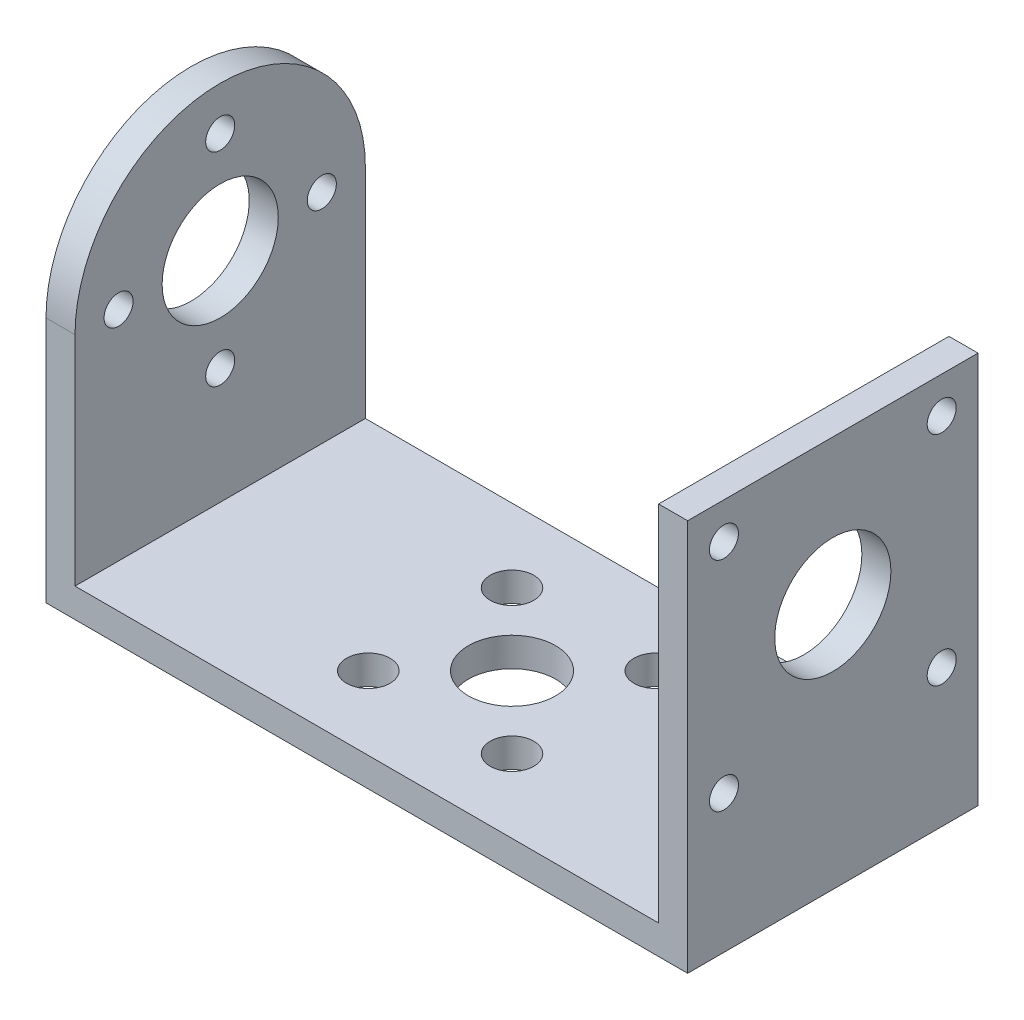
ISO-10303-21;
HEADER;
FILE_DESCRIPTION(('STEP AP214'),'2;1');
FILE_NAME('part.step','',(''),(''),'','','');
FILE_SCHEMA(('AUTOMOTIVE_DESIGN { 1 0 10303 214 1 1 1 1 }'));
ENDSEC;
DATA;
#1=APPLICATION_CONTEXT('core data for automotive mechanical design processes');
#2=APPLICATION_PROTOCOL_DEFINITION('international standard','automotive_design',2000,#1);
#3=PRODUCT_CONTEXT('',#1,'mechanical');
#4=PRODUCT('Part','Part','',(#3));
#5=PRODUCT_RELATED_PRODUCT_CATEGORY('part','',(#4));
#6=PRODUCT_DEFINITION_FORMATION('','',#4);
#7=PRODUCT_DEFINITION_CONTEXT('part definition',#1,'design');
#8=PRODUCT_DEFINITION('design','',#6,#7);
#9=PRODUCT_DEFINITION_SHAPE('','',#8);
#10=(LENGTH_UNIT() NAMED_UNIT(*) SI_UNIT(.MILLI.,.METRE.));
#11=(NAMED_UNIT(*) PLANE_ANGLE_UNIT() SI_UNIT($,.RADIAN.));
#12=(NAMED_UNIT(*) SI_UNIT($,.STERADIAN.) SOLID_ANGLE_UNIT());
#13=UNCERTAINTY_MEASURE_WITH_UNIT(LENGTH_MEASURE(1.E-05),#10,'distance_accuracy_value','');
#14=(GEOMETRIC_REPRESENTATION_CONTEXT(3) GLOBAL_UNCERTAINTY_ASSIGNED_CONTEXT((#13)) GLOBAL_UNIT_ASSIGNED_CONTEXT((#10,
#11,#12)) REPRESENTATION_CONTEXT('',''));
#15=CARTESIAN_POINT('',(0.,0.,0.));
#16=DIRECTION('',(0.,0.,1.));
#17=DIRECTION('',(1.,0.,0.));
#18=AXIS2_PLACEMENT_3D('',#15,#16,#17);
#19=CARTESIAN_POINT('',(-22.1,2.,10.));
#20=DIRECTION('',(1.,0.,0.));
#21=DIRECTION('',(0.,0.,-1.));
#22=AXIS2_PLACEMENT_3D('',#19,#20,#21);
#23=PLANE('',#22);
#24=CARTESIAN_POINT('',(-22.1,17.,0.));
#25=DIRECTION('',(-1.,0.,0.));
#26=DIRECTION('',(0.,0.,1.));
#27=AXIS2_PLACEMENT_3D('',#24,#25,#26);
#28=CIRCLE('',#27,4.);
#29=CARTESIAN_POINT('',(-22.1,17.,4.));
#30=VERTEX_POINT('',#29);
#31=EDGE_CURVE('E288',#30,#30,#28,.T.);
#32=ORIENTED_EDGE('',*,*,#31,.F.);
#33=EDGE_LOOP('',(#32));
#34=FACE_BOUND('',#33,.T.);
#35=CARTESIAN_POINT('',(-22.1,10.,3.46818829043387E-13));
#36=DIRECTION('',(-1.,0.,0.));
#37=DIRECTION('',(0.,0.,1.));
#38=AXIS2_PLACEMENT_3D('',#35,#36,#37);
#39=CIRCLE('',#38,1.);
#40=CARTESIAN_POINT('',(-22.1,10.,1.00000000000035));
#41=VERTEX_POINT('',#40);
#42=EDGE_CURVE('E187',#41,#41,#39,.T.);
#43=ORIENTED_EDGE('',*,*,#42,.F.);
#44=EDGE_LOOP('',(#43));
#45=FACE_BOUND('',#44,.T.);
#46=CARTESIAN_POINT('',(-22.1,16.9999999999999,-6.9999999999998));
#47=DIRECTION('',(-1.,0.,0.));
#48=DIRECTION('',(0.,0.,1.));
#49=AXIS2_PLACEMENT_3D('',#46,#47,#48);
#50=CIRCLE('',#49,0.999999999999999);
#51=CARTESIAN_POINT('',(-22.1,16.9999999999999,-5.9999999999998));
#52=VERTEX_POINT('',#51);
#53=EDGE_CURVE('E265',#52,#52,#50,.T.);
#54=ORIENTED_EDGE('',*,*,#53,.F.);
#55=EDGE_LOOP('',(#54));
#56=FACE_BOUND('',#55,.T.);
#57=CARTESIAN_POINT('',(-22.1,24.,0.));
#58=DIRECTION('',(-1.,0.,0.));
#59=DIRECTION('',(0.,0.,1.));
#60=AXIS2_PLACEMENT_3D('',#57,#58,#59);
#61=CIRCLE('',#60,1.);
#62=CARTESIAN_POINT('',(-22.1,24.,1.));
#63=VERTEX_POINT('',#62);
#64=EDGE_CURVE('E272',#63,#63,#61,.T.);
#65=ORIENTED_EDGE('',*,*,#64,.F.);
#66=EDGE_LOOP('',(#65));
#67=FACE_BOUND('',#66,.T.);
#68=CARTESIAN_POINT('',(-22.1,17.0000000000002,7.0000000000002));
#69=DIRECTION('',(-1.,0.,0.));
#70=DIRECTION('',(0.,0.,1.));
#71=AXIS2_PLACEMENT_3D('',#68,#69,#70);
#72=CIRCLE('',#71,1.);
#73=CARTESIAN_POINT('',(-22.1,17.0000000000002,8.0000000000002));
#74=VERTEX_POINT('',#73);
#75=EDGE_CURVE('E278',#74,#74,#72,.T.);
#76=ORIENTED_EDGE('',*,*,#75,.F.);
#77=EDGE_LOOP('',(#76));
#78=FACE_BOUND('',#77,.T.);
#79=CARTESIAN_POINT('',(-22.1,17.,0.));
#80=DIRECTION('',(-1.,0.,0.));
#81=DIRECTION('',(0.,0.,1.));
#82=AXIS2_PLACEMENT_3D('',#79,#80,#81);
#83=CIRCLE('',#82,10.);
#84=CARTESIAN_POINT('',(-22.1,17.,10.));
#85=VERTEX_POINT('',#84);
#86=CARTESIAN_POINT('',(-22.1,17.,-10.));
#87=VERTEX_POINT('',#86);
#88=EDGE_CURVE('E173',#85,#87,#83,.T.);
#89=ORIENTED_EDGE('',*,*,#88,.T.);
#90=DIRECTION('',(0.,-1.,0.));
#91=VECTOR('',#90,1.);
#92=CARTESIAN_POINT('',(-22.1,2.,-10.));
#93=LINE('',#92,#91);
#94=CARTESIAN_POINT('',(-22.1,0.,-10.));
#95=VERTEX_POINT('',#94);
#96=EDGE_CURVE('E116',#87,#95,#93,.T.);
#97=ORIENTED_EDGE('',*,*,#96,.T.);
#98=DIRECTION('',(0.,0.,1.));
#99=VECTOR('',#98,1.);
#100=CARTESIAN_POINT('',(-22.1,0.,10.));
#101=LINE('',#100,#99);
#102=CARTESIAN_POINT('',(-22.1,0.,10.));
#103=VERTEX_POINT('',#102);
#104=EDGE_CURVE('E200',#95,#103,#101,.T.);
#105=ORIENTED_EDGE('',*,*,#104,.T.);
#106=DIRECTION('',(0.,-1.,0.));
#107=VECTOR('',#106,1.);
#108=CARTESIAN_POINT('',(-22.1,2.,10.));
#109=LINE('',#108,#107);
#110=EDGE_CURVE('E178',#85,#103,#109,.T.);
#111=ORIENTED_EDGE('',*,*,#110,.F.);
#112=EDGE_LOOP('',(#89,#97,#105,#111));
#113=FACE_BOUND('',#112,.T.);
#114=ADVANCED_FACE('F108',(#34,#45,#56,#67,#78,#113),#23,.F.);
#115=CARTESIAN_POINT('',(-20.1,0.,0.));
#116=DIRECTION('',(1.,0.,0.));
#117=DIRECTION('',(0.,0.,-1.));
#118=AXIS2_PLACEMENT_3D('',#115,#116,#117);
#119=PLANE('',#118);
#120=CARTESIAN_POINT('',(-20.1,17.,0.));
#121=DIRECTION('',(1.,0.,0.));
#122=DIRECTION('',(0.,0.,-1.));
#123=AXIS2_PLACEMENT_3D('',#120,#121,#122);
#124=CIRCLE('',#123,4.);
#125=CARTESIAN_POINT('',(-20.1,17.,-4.));
#126=VERTEX_POINT('',#125);
#127=EDGE_CURVE('E291',#126,#126,#124,.F.);
#128=ORIENTED_EDGE('',*,*,#127,.T.);
#129=EDGE_LOOP('',(#128));
#130=FACE_BOUND('',#129,.T.);
#131=CARTESIAN_POINT('',(-20.1,10.,3.46818829043387E-13));
#132=DIRECTION('',(1.,0.,0.));
#133=DIRECTION('',(0.,0.,-1.));
#134=AXIS2_PLACEMENT_3D('',#131,#132,#133);
#135=CIRCLE('',#134,1.);
#136=CARTESIAN_POINT('',(-20.1,10.,-0.999999999999654));
#137=VERTEX_POINT('',#136);
#138=EDGE_CURVE('E285',#137,#137,#135,.F.);
#139=ORIENTED_EDGE('',*,*,#138,.T.);
#140=EDGE_LOOP('',(#139));
#141=FACE_BOUND('',#140,.T.);
#142=CARTESIAN_POINT('',(-20.1,17.0000000000002,7.0000000000002));
#143=DIRECTION('',(1.,0.,0.));
#144=DIRECTION('',(0.,0.,-1.));
#145=AXIS2_PLACEMENT_3D('',#142,#143,#144);
#146=CIRCLE('',#145,1.);
#147=CARTESIAN_POINT('',(-20.1,17.0000000000002,6.0000000000002));
#148=VERTEX_POINT('',#147);
#149=EDGE_CURVE('E186',#148,#148,#146,.F.);
#150=ORIENTED_EDGE('',*,*,#149,.T.);
#151=EDGE_LOOP('',(#150));
#152=FACE_BOUND('',#151,.T.);
#153=CARTESIAN_POINT('',(-20.1,24.,0.));
#154=DIRECTION('',(1.,0.,0.));
#155=DIRECTION('',(0.,0.,-1.));
#156=AXIS2_PLACEMENT_3D('',#153,#154,#155);
#157=CIRCLE('',#156,1.);
#158=CARTESIAN_POINT('',(-20.1,24.,-1.));
#159=VERTEX_POINT('',#158);
#160=EDGE_CURVE('E275',#159,#159,#157,.F.);
#161=ORIENTED_EDGE('',*,*,#160,.T.);
#162=EDGE_LOOP('',(#161));
#163=FACE_BOUND('',#162,.T.);
#164=CARTESIAN_POINT('',(-20.1,16.9999999999999,-6.9999999999998));
#165=DIRECTION('',(1.,0.,0.));
#166=DIRECTION('',(0.,0.,-1.));
#167=AXIS2_PLACEMENT_3D('',#164,#165,#166);
#168=CIRCLE('',#167,0.999999999999999);
#169=CARTESIAN_POINT('',(-20.1,16.9999999999999,-7.9999999999998));
#170=VERTEX_POINT('',#169);
#171=EDGE_CURVE('E269',#170,#170,#168,.F.);
#172=ORIENTED_EDGE('',*,*,#171,.T.);
#173=EDGE_LOOP('',(#172));
#174=FACE_BOUND('',#173,.T.);
#175=DIRECTION('',(0.,-1.,0.));
#176=VECTOR('',#175,1.);
#177=CARTESIAN_POINT('',(-20.1,2.,-10.));
#178=LINE('',#177,#176);
#179=CARTESIAN_POINT('',(-20.1,17.,-10.));
#180=VERTEX_POINT('',#179);
#181=CARTESIAN_POINT('',(-20.1,2.,-10.));
#182=VERTEX_POINT('',#181);
#183=EDGE_CURVE('E244',#180,#182,#178,.T.);
#184=ORIENTED_EDGE('',*,*,#183,.F.);
#185=CARTESIAN_POINT('',(-20.1,17.,0.));
#186=DIRECTION('',(1.,0.,0.));
#187=DIRECTION('',(0.,0.,-1.));
#188=AXIS2_PLACEMENT_3D('',#185,#186,#187);
#189=CIRCLE('',#188,10.);
#190=CARTESIAN_POINT('',(-20.1,17.,10.));
#191=VERTEX_POINT('',#190);
#192=EDGE_CURVE('E179',#191,#180,#189,.F.);
#193=ORIENTED_EDGE('',*,*,#192,.F.);
#194=DIRECTION('',(0.,1.,0.));
#195=VECTOR('',#194,1.);
#196=CARTESIAN_POINT('',(-20.1,2.,10.));
#197=LINE('',#196,#195);
#198=CARTESIAN_POINT('',(-20.1,2.,10.));
#199=VERTEX_POINT('',#198);
#200=EDGE_CURVE('E220',#199,#191,#197,.T.);
#201=ORIENTED_EDGE('',*,*,#200,.F.);
#202=DIRECTION('',(0.,0.,1.));
#203=VECTOR('',#202,1.);
#204=CARTESIAN_POINT('',(-20.1,2.,-10.));
#205=LINE('',#204,#203);
#206=EDGE_CURVE('E242',#182,#199,#205,.T.);
#207=ORIENTED_EDGE('',*,*,#206,.F.);
#208=EDGE_LOOP('',(#184,#193,#201,#207));
#209=FACE_BOUND('',#208,.T.);
#210=ADVANCED_FACE('F362',(#130,#141,#152,#163,#174,#209),#119,.T.);
#211=CARTESIAN_POINT('',(-22.1,2.,-10.));
#212=DIRECTION('',(0.,0.,1.));
#213=DIRECTION('',(1.,0.,0.));
#214=AXIS2_PLACEMENT_3D('',#211,#212,#213);
#215=PLANE('',#214);
#216=DIRECTION('',(-1.,0.,0.));
#217=VECTOR('',#216,1.);
#218=CARTESIAN_POINT('',(22.101,17.,-10.));
#219=LINE('',#218,#217);
#220=EDGE_CURVE('E182',#180,#87,#219,.T.);
#221=ORIENTED_EDGE('',*,*,#220,.F.);
#222=ORIENTED_EDGE('',*,*,#183,.T.);
#223=DIRECTION('',(-1.,0.,0.));
#224=VECTOR('',#223,1.);
#225=CARTESIAN_POINT('',(-22.1,2.,-10.));
#226=LINE('',#225,#224);
#227=CARTESIAN_POINT('',(20.1,2.,-10.));
#228=VERTEX_POINT('',#227);
#229=EDGE_CURVE('E199',#228,#182,#226,.T.);
#230=ORIENTED_EDGE('',*,*,#229,.F.);
#231=DIRECTION('',(0.,-1.,0.));
#232=VECTOR('',#231,1.);
#233=CARTESIAN_POINT('',(20.1,2.,-10.));
#234=LINE('',#233,#232);
#235=CARTESIAN_POINT('',(20.1,27.,-10.));
#236=VERTEX_POINT('',#235);
#237=EDGE_CURVE('E256',#236,#228,#234,.T.);
#238=ORIENTED_EDGE('',*,*,#237,.F.);
#239=DIRECTION('',(1.,0.,0.));
#240=VECTOR('',#239,1.);
#241=CARTESIAN_POINT('',(20.1,27.,-10.));
#242=LINE('',#241,#240);
#243=CARTESIAN_POINT('',(22.1,27.,-10.));
#244=VERTEX_POINT('',#243);
#245=EDGE_CURVE('E247',#236,#244,#242,.T.);
#246=ORIENTED_EDGE('',*,*,#245,.T.);
#247=DIRECTION('',(0.,-1.,0.));
#248=VECTOR('',#247,1.);
#249=CARTESIAN_POINT('',(22.1,2.,-10.));
#250=LINE('',#249,#248);
#251=CARTESIAN_POINT('',(22.1,0.,-10.));
#252=VERTEX_POINT('',#251);
#253=EDGE_CURVE('E12',#244,#252,#250,.T.);
#254=ORIENTED_EDGE('',*,*,#253,.T.);
#255=DIRECTION('',(-1.,0.,0.));
#256=VECTOR('',#255,1.);
#257=CARTESIAN_POINT('',(-22.1,0.,-10.));
#258=LINE('',#257,#256);
#259=EDGE_CURVE('E190',#252,#95,#258,.T.);
#260=ORIENTED_EDGE('',*,*,#259,.T.);
#261=ORIENTED_EDGE('',*,*,#96,.F.);
#262=EDGE_LOOP('',(#221,#222,#230,#238,#246,#254,#260,#261));
#263=FACE_BOUND('',#262,.T.);
#264=ADVANCED_FACE('F189',(#263),#215,.F.);
#265=CARTESIAN_POINT('',(22.1,2.,10.));
#266=DIRECTION('',(-1.,0.,0.));
#267=DIRECTION('',(0.,0.,1.));
#268=AXIS2_PLACEMENT_3D('',#265,#266,#267);
#269=PLANE('',#268);
#270=CARTESIAN_POINT('',(22.1,24.5,7.5));
#271=DIRECTION('',(1.,0.,0.));
#272=DIRECTION('',(0.,0.,-1.));
#273=AXIS2_PLACEMENT_3D('',#270,#271,#272);
#274=CIRCLE('',#273,1.);
#275=CARTESIAN_POINT('',(22.1,24.5,6.5));
#276=VERTEX_POINT('',#275);
#277=EDGE_CURVE('E298',#276,#276,#274,.T.);
#278=ORIENTED_EDGE('',*,*,#277,.F.);
#279=EDGE_LOOP('',(#278));
#280=FACE_BOUND('',#279,.T.);
#281=CARTESIAN_POINT('',(22.1,24.5,-7.5));
#282=DIRECTION('',(1.,0.,0.));
#283=DIRECTION('',(0.,0.,-1.));
#284=AXIS2_PLACEMENT_3D('',#281,#282,#283);
#285=CIRCLE('',#284,1.);
#286=CARTESIAN_POINT('',(22.1,24.5,-8.5));
#287=VERTEX_POINT('',#286);
#288=EDGE_CURVE('E314',#287,#287,#285,.T.);
#289=ORIENTED_EDGE('',*,*,#288,.F.);
#290=EDGE_LOOP('',(#289));
#291=FACE_BOUND('',#290,.T.);
#292=CARTESIAN_POINT('',(22.1,9.5,-7.50000000000016));
#293=DIRECTION('',(1.,0.,0.));
#294=DIRECTION('',(0.,0.,-1.));
#295=AXIS2_PLACEMENT_3D('',#292,#293,#294);
#296=CIRCLE('',#295,1.);
#297=CARTESIAN_POINT('',(22.1,9.5,-8.50000000000016));
#298=VERTEX_POINT('',#297);
#299=EDGE_CURVE('E310',#298,#298,#296,.T.);
#300=ORIENTED_EDGE('',*,*,#299,.F.);
#301=EDGE_LOOP('',(#300));
#302=FACE_BOUND('',#301,.T.);
#303=CARTESIAN_POINT('',(22.1,9.5,7.49999999999984));
#304=DIRECTION('',(1.,0.,0.));
#305=DIRECTION('',(0.,0.,-1.));
#306=AXIS2_PLACEMENT_3D('',#303,#304,#305);
#307=CIRCLE('',#306,1.);
#308=CARTESIAN_POINT('',(22.1,9.5,6.49999999999984));
#309=VERTEX_POINT('',#308);
#310=EDGE_CURVE('E304',#309,#309,#307,.T.);
#311=ORIENTED_EDGE('',*,*,#310,.F.);
#312=EDGE_LOOP('',(#311));
#313=FACE_BOUND('',#312,.T.);
#314=CARTESIAN_POINT('',(22.1,17.,0.));
#315=DIRECTION('',(1.,0.,0.));
#316=DIRECTION('',(0.,0.,-1.));
#317=AXIS2_PLACEMENT_3D('',#314,#315,#316);
#318=CIRCLE('',#317,4.);
#319=CARTESIAN_POINT('',(22.1,17.,-4.));
#320=VERTEX_POINT('',#319);
#321=EDGE_CURVE('E294',#320,#320,#318,.T.);
#322=ORIENTED_EDGE('',*,*,#321,.F.);
#323=EDGE_LOOP('',(#322));
#324=FACE_BOUND('',#323,.T.);
#325=DIRECTION('',(0.,0.,-1.));
#326=VECTOR('',#325,1.);
#327=CARTESIAN_POINT('',(22.1,0.,10.));
#328=LINE('',#327,#326);
#329=CARTESIAN_POINT('',(22.1,0.,10.));
#330=VERTEX_POINT('',#329);
#331=EDGE_CURVE('E203',#330,#252,#328,.T.);
#332=ORIENTED_EDGE('',*,*,#331,.T.);
#333=ORIENTED_EDGE('',*,*,#253,.F.);
#334=DIRECTION('',(0.,0.,-1.));
#335=VECTOR('',#334,1.);
#336=CARTESIAN_POINT('',(22.1,27.,-10.));
#337=LINE('',#336,#335);
#338=CARTESIAN_POINT('',(22.1,27.,10.));
#339=VERTEX_POINT('',#338);
#340=EDGE_CURVE('E253',#339,#244,#337,.T.);
#341=ORIENTED_EDGE('',*,*,#340,.F.);
#342=DIRECTION('',(0.,-1.,0.));
#343=VECTOR('',#342,1.);
#344=CARTESIAN_POINT('',(22.1,2.,10.));
#345=LINE('',#344,#343);
#346=EDGE_CURVE('E192',#339,#330,#345,.T.);
#347=ORIENTED_EDGE('',*,*,#346,.T.);
#348=EDGE_LOOP('',(#332,#333,#341,#347));
#349=FACE_BOUND('',#348,.T.);
#350=ADVANCED_FACE('F110',(#280,#291,#302,#313,#324,#349),#269,.F.);
#351=CARTESIAN_POINT('',(-22.1,2.,10.));
#352=DIRECTION('',(0.,0.,-1.));
#353=DIRECTION('',(-1.,0.,0.));
#354=AXIS2_PLACEMENT_3D('',#351,#352,#353);
#355=PLANE('',#354);
#356=ORIENTED_EDGE('',*,*,#200,.T.);
#357=DIRECTION('',(-1.,0.,0.));
#358=VECTOR('',#357,1.);
#359=CARTESIAN_POINT('',(22.101,17.,10.));
#360=LINE('',#359,#358);
#361=EDGE_CURVE('E123',#191,#85,#360,.T.);
#362=ORIENTED_EDGE('',*,*,#361,.T.);
#363=ORIENTED_EDGE('',*,*,#110,.T.);
#364=DIRECTION('',(1.,0.,0.));
#365=VECTOR('',#364,1.);
#366=CARTESIAN_POINT('',(-22.1,0.,10.));
#367=LINE('',#366,#365);
#368=EDGE_CURVE('E197',#103,#330,#367,.T.);
#369=ORIENTED_EDGE('',*,*,#368,.T.);
#370=ORIENTED_EDGE('',*,*,#346,.F.);
#371=DIRECTION('',(1.,0.,0.));
#372=VECTOR('',#371,1.);
#373=CARTESIAN_POINT('',(20.1,27.,10.));
#374=LINE('',#373,#372);
#375=CARTESIAN_POINT('',(20.1,27.,10.));
#376=VERTEX_POINT('',#375);
#377=EDGE_CURVE('E246',#376,#339,#374,.T.);
#378=ORIENTED_EDGE('',*,*,#377,.F.);
#379=DIRECTION('',(0.,1.,0.));
#380=VECTOR('',#379,1.);
#381=CARTESIAN_POINT('',(20.1,2.,10.));
#382=LINE('',#381,#380);
#383=CARTESIAN_POINT('',(20.1,2.,10.));
#384=VERTEX_POINT('',#383);
#385=EDGE_CURVE('E258',#384,#376,#382,.T.);
#386=ORIENTED_EDGE('',*,*,#385,.F.);
#387=DIRECTION('',(1.,0.,0.));
#388=VECTOR('',#387,1.);
#389=CARTESIAN_POINT('',(-22.1,2.,10.));
#390=LINE('',#389,#388);
#391=EDGE_CURVE('E131',#199,#384,#390,.T.);
#392=ORIENTED_EDGE('',*,*,#391,.F.);
#393=EDGE_LOOP('',(#356,#362,#363,#369,#370,#378,#386,#392));
#394=FACE_BOUND('',#393,.T.);
#395=ADVANCED_FACE('F337',(#394),#355,.F.);
#396=CARTESIAN_POINT('',(0.,2.,0.));
#397=DIRECTION('',(0.,-1.,0.));
#398=DIRECTION('',(0.,0.,-1.));
#399=AXIS2_PLACEMENT_3D('',#396,#397,#398);
#400=PLANE('',#399);
#401=CARTESIAN_POINT('',(4.94974746830581,2.,4.94974746830581));
#402=DIRECTION('',(0.,1.,0.));
#403=DIRECTION('',(0.,0.,1.));
#404=AXIS2_PLACEMENT_3D('',#401,#402,#403);
#405=CIRCLE('',#404,1.5000000000001);
#406=CARTESIAN_POINT('',(4.94974746830581,2.,6.44974746830591));
#407=VERTEX_POINT('',#406);
#408=EDGE_CURVE('E213',#407,#407,#405,.T.);
#409=ORIENTED_EDGE('',*,*,#408,.F.);
#410=EDGE_LOOP('',(#409));
#411=FACE_BOUND('',#410,.T.);
#412=CARTESIAN_POINT('',(-4.94974746830586,2.,4.94974746830581));
#413=DIRECTION('',(0.,1.,0.));
#414=DIRECTION('',(0.,0.,1.));
#415=AXIS2_PLACEMENT_3D('',#412,#413,#414);
#416=CIRCLE('',#415,1.50000000000009);
#417=CARTESIAN_POINT('',(-4.94974746830586,2.,6.4497474683059));
#418=VERTEX_POINT('',#417);
#419=EDGE_CURVE('E232',#418,#418,#416,.T.);
#420=ORIENTED_EDGE('',*,*,#419,.F.);
#421=EDGE_LOOP('',(#420));
#422=FACE_BOUND('',#421,.T.);
#423=CARTESIAN_POINT('',(-4.94974746830586,2.,-4.94974746830585));
#424=DIRECTION('',(0.,1.,0.));
#425=DIRECTION('',(0.,0.,1.));
#426=AXIS2_PLACEMENT_3D('',#423,#424,#425);
#427=CIRCLE('',#426,1.50000000000002);
#428=CARTESIAN_POINT('',(-4.94974746830586,2.,-3.44974746830583));
#429=VERTEX_POINT('',#428);
#430=EDGE_CURVE('E226',#429,#429,#427,.T.);
#431=ORIENTED_EDGE('',*,*,#430,.F.);
#432=EDGE_LOOP('',(#431));
#433=FACE_BOUND('',#432,.T.);
#434=CARTESIAN_POINT('',(4.94974746830583,2.,-4.94974746830585));
#435=DIRECTION('',(0.,1.,0.));
#436=DIRECTION('',(0.,0.,1.));
#437=AXIS2_PLACEMENT_3D('',#434,#435,#436);
#438=CIRCLE('',#437,1.5);
#439=CARTESIAN_POINT('',(4.94974746830583,2.,-3.44974746830585));
#440=VERTEX_POINT('',#439);
#441=EDGE_CURVE('E219',#440,#440,#438,.T.);
#442=ORIENTED_EDGE('',*,*,#441,.F.);
#443=EDGE_LOOP('',(#442));
#444=FACE_BOUND('',#443,.T.);
#445=CARTESIAN_POINT('',(0.,2.,0.));
#446=DIRECTION('',(0.,1.,0.));
#447=DIRECTION('',(0.,0.,1.));
#448=AXIS2_PLACEMENT_3D('',#445,#446,#447);
#449=CIRCLE('',#448,3.);
#450=CARTESIAN_POINT('',(0.,2.,3.));
#451=VERTEX_POINT('',#450);
#452=EDGE_CURVE('E206',#451,#451,#449,.T.);
#453=ORIENTED_EDGE('',*,*,#452,.F.);
#454=EDGE_LOOP('',(#453));
#455=FACE_BOUND('',#454,.T.);
#456=ORIENTED_EDGE('',*,*,#391,.T.);
#457=DIRECTION('',(0.,0.,1.));
#458=VECTOR('',#457,1.);
#459=CARTESIAN_POINT('',(20.1,2.,-10.));
#460=LINE('',#459,#458);
#461=EDGE_CURVE('E250',#228,#384,#460,.T.);
#462=ORIENTED_EDGE('',*,*,#461,.F.);
#463=ORIENTED_EDGE('',*,*,#229,.T.);
#464=ORIENTED_EDGE('',*,*,#206,.T.);
#465=EDGE_LOOP('',(#456,#462,#463,#464));
#466=FACE_BOUND('',#465,.T.);
#467=ADVANCED_FACE('F363',(#411,#422,#433,#444,#455,#466),#400,.F.);
#468=CARTESIAN_POINT('',(0.,0.,0.));
#469=DIRECTION('',(0.,-1.,0.));
#470=DIRECTION('',(0.,0.,-1.));
#471=AXIS2_PLACEMENT_3D('',#468,#469,#470);
#472=PLANE('',#471);
#473=CARTESIAN_POINT('',(4.94974746830581,0.,4.94974746830581));
#474=DIRECTION('',(0.,-1.,0.));
#475=DIRECTION('',(0.,0.,-1.));
#476=AXIS2_PLACEMENT_3D('',#473,#474,#475);
#477=CIRCLE('',#476,1.5000000000001);
#478=CARTESIAN_POINT('',(4.94974746830581,0.,3.44974746830571));
#479=VERTEX_POINT('',#478);
#480=EDGE_CURVE('E235',#479,#479,#477,.F.);
#481=ORIENTED_EDGE('',*,*,#480,.T.);
#482=EDGE_LOOP('',(#481));
#483=FACE_BOUND('',#482,.T.);
#484=CARTESIAN_POINT('',(-4.94974746830586,0.,4.94974746830581));
#485=DIRECTION('',(0.,-1.,0.));
#486=DIRECTION('',(0.,0.,-1.));
#487=AXIS2_PLACEMENT_3D('',#484,#485,#486);
#488=CIRCLE('',#487,1.50000000000009);
#489=CARTESIAN_POINT('',(-4.94974746830586,0.,3.44974746830573));
#490=VERTEX_POINT('',#489);
#491=EDGE_CURVE('E229',#490,#490,#488,.F.);
#492=ORIENTED_EDGE('',*,*,#491,.T.);
#493=EDGE_LOOP('',(#492));
#494=FACE_BOUND('',#493,.T.);
#495=CARTESIAN_POINT('',(-4.94974746830586,0.,-4.94974746830585));
#496=DIRECTION('',(0.,-1.,0.));
#497=DIRECTION('',(0.,0.,-1.));
#498=AXIS2_PLACEMENT_3D('',#495,#496,#497);
#499=CIRCLE('',#498,1.50000000000002);
#500=CARTESIAN_POINT('',(-4.94974746830586,0.,-6.44974746830587));
#501=VERTEX_POINT('',#500);
#502=EDGE_CURVE('E223',#501,#501,#499,.F.);
#503=ORIENTED_EDGE('',*,*,#502,.T.);
#504=EDGE_LOOP('',(#503));
#505=FACE_BOUND('',#504,.T.);
#506=CARTESIAN_POINT('',(4.94974746830583,0.,-4.94974746830585));
#507=DIRECTION('',(0.,-1.,0.));
#508=DIRECTION('',(0.,0.,-1.));
#509=AXIS2_PLACEMENT_3D('',#506,#507,#508);
#510=CIRCLE('',#509,1.5);
#511=CARTESIAN_POINT('',(4.94974746830583,0.,-6.44974746830585));
#512=VERTEX_POINT('',#511);
#513=EDGE_CURVE('E216',#512,#512,#510,.F.);
#514=ORIENTED_EDGE('',*,*,#513,.T.);
#515=EDGE_LOOP('',(#514));
#516=FACE_BOUND('',#515,.T.);
#517=CARTESIAN_POINT('',(0.,0.,0.));
#518=DIRECTION('',(0.,-1.,0.));
#519=DIRECTION('',(0.,0.,-1.));
#520=AXIS2_PLACEMENT_3D('',#517,#518,#519);
#521=CIRCLE('',#520,3.);
#522=CARTESIAN_POINT('',(0.,0.,-3.));
#523=VERTEX_POINT('',#522);
#524=EDGE_CURVE('E210',#523,#523,#521,.F.);
#525=ORIENTED_EDGE('',*,*,#524,.T.);
#526=EDGE_LOOP('',(#525));
#527=FACE_BOUND('',#526,.T.);
#528=ORIENTED_EDGE('',*,*,#331,.F.);
#529=ORIENTED_EDGE('',*,*,#368,.F.);
#530=ORIENTED_EDGE('',*,*,#104,.F.);
#531=ORIENTED_EDGE('',*,*,#259,.F.);
#532=EDGE_LOOP('',(#528,#529,#530,#531));
#533=FACE_BOUND('',#532,.T.);
#534=ADVANCED_FACE('F350',(#483,#494,#505,#516,#527,#533),#472,.T.);
#535=CARTESIAN_POINT('',(0.,-0.00100000000000013,0.));
#536=DIRECTION('',(0.,1.,0.));
#537=DIRECTION('',(0.,0.,1.));
#538=AXIS2_PLACEMENT_3D('',#535,#536,#537);
#539=CYLINDRICAL_SURFACE('',#538,3.);
#540=ORIENTED_EDGE('',*,*,#524,.F.);
#541=EDGE_LOOP('',(#540));
#542=FACE_BOUND('',#541,.T.);
#543=ORIENTED_EDGE('',*,*,#452,.T.);
#544=EDGE_LOOP('',(#543));
#545=FACE_BOUND('',#544,.T.);
#546=ADVANCED_FACE('F418',(#542,#545),#539,.F.);
#547=CARTESIAN_POINT('',(4.94974746830583,-0.00100000000000013,-4.94974746830585));
#548=DIRECTION('',(0.,1.,0.));
#549=DIRECTION('',(0.,0.,1.));
#550=AXIS2_PLACEMENT_3D('',#547,#548,#549);
#551=CYLINDRICAL_SURFACE('',#550,1.5);
#552=ORIENTED_EDGE('',*,*,#513,.F.);
#553=EDGE_LOOP('',(#552));
#554=FACE_BOUND('',#553,.T.);
#555=ORIENTED_EDGE('',*,*,#441,.T.);
#556=EDGE_LOOP('',(#555));
#557=FACE_BOUND('',#556,.T.);
#558=ADVANCED_FACE('F425',(#554,#557),#551,.F.);
#559=CARTESIAN_POINT('',(-4.94974746830586,-0.00100000000000013,-4.94974746830585));
#560=DIRECTION('',(0.,1.,0.));
#561=DIRECTION('',(0.,0.,1.));
#562=AXIS2_PLACEMENT_3D('',#559,#560,#561);
#563=CYLINDRICAL_SURFACE('',#562,1.50000000000002);
#564=ORIENTED_EDGE('',*,*,#502,.F.);
#565=EDGE_LOOP('',(#564));
#566=FACE_BOUND('',#565,.T.);
#567=ORIENTED_EDGE('',*,*,#430,.T.);
#568=EDGE_LOOP('',(#567));
#569=FACE_BOUND('',#568,.T.);
#570=ADVANCED_FACE('F433',(#566,#569),#563,.F.);
#571=CARTESIAN_POINT('',(-4.94974746830586,-0.00100000000000013,4.94974746830581));
#572=DIRECTION('',(0.,1.,0.));
#573=DIRECTION('',(0.,0.,1.));
#574=AXIS2_PLACEMENT_3D('',#571,#572,#573);
#575=CYLINDRICAL_SURFACE('',#574,1.50000000000009);
#576=ORIENTED_EDGE('',*,*,#491,.F.);
#577=EDGE_LOOP('',(#576));
#578=FACE_BOUND('',#577,.T.);
#579=ORIENTED_EDGE('',*,*,#419,.T.);
#580=EDGE_LOOP('',(#579));
#581=FACE_BOUND('',#580,.T.);
#582=ADVANCED_FACE('F441',(#578,#581),#575,.F.);
#583=CARTESIAN_POINT('',(4.94974746830581,-0.00100000000000013,4.94974746830581));
#584=DIRECTION('',(0.,1.,0.));
#585=DIRECTION('',(0.,0.,1.));
#586=AXIS2_PLACEMENT_3D('',#583,#584,#585);
#587=CYLINDRICAL_SURFACE('',#586,1.5000000000001);
#588=ORIENTED_EDGE('',*,*,#480,.F.);
#589=EDGE_LOOP('',(#588));
#590=FACE_BOUND('',#589,.T.);
#591=ORIENTED_EDGE('',*,*,#408,.T.);
#592=EDGE_LOOP('',(#591));
#593=FACE_BOUND('',#592,.T.);
#594=ADVANCED_FACE('F373',(#590,#593),#587,.F.);
#595=CARTESIAN_POINT('',(20.1,27.,-10.));
#596=DIRECTION('',(0.,-1.,0.));
#597=DIRECTION('',(0.,0.,-1.));
#598=AXIS2_PLACEMENT_3D('',#595,#596,#597);
#599=PLANE('',#598);
#600=ORIENTED_EDGE('',*,*,#340,.T.);
#601=ORIENTED_EDGE('',*,*,#245,.F.);
#602=DIRECTION('',(0.,0.,-1.));
#603=VECTOR('',#602,1.);
#604=CARTESIAN_POINT('',(20.1,27.,-10.));
#605=LINE('',#604,#603);
#606=EDGE_CURVE('E260',#376,#236,#605,.T.);
#607=ORIENTED_EDGE('',*,*,#606,.F.);
#608=ORIENTED_EDGE('',*,*,#377,.T.);
#609=EDGE_LOOP('',(#600,#601,#607,#608));
#610=FACE_BOUND('',#609,.T.);
#611=ADVANCED_FACE('F356',(#610),#599,.F.);
#612=CARTESIAN_POINT('',(20.1,0.,0.));
#613=DIRECTION('',(-1.,0.,0.));
#614=DIRECTION('',(0.,0.,-1.));
#615=AXIS2_PLACEMENT_3D('',#612,#613,#614);
#616=PLANE('',#615);
#617=CARTESIAN_POINT('',(20.1,24.5,7.5));
#618=DIRECTION('',(-1.,0.,0.));
#619=DIRECTION('',(0.,0.,1.));
#620=AXIS2_PLACEMENT_3D('',#617,#618,#619);
#621=CIRCLE('',#620,1.);
#622=CARTESIAN_POINT('',(20.1,24.5,8.5));
#623=VERTEX_POINT('',#622);
#624=EDGE_CURVE('E317',#623,#623,#621,.F.);
#625=ORIENTED_EDGE('',*,*,#624,.T.);
#626=EDGE_LOOP('',(#625));
#627=FACE_BOUND('',#626,.T.);
#628=CARTESIAN_POINT('',(20.1,24.5,-7.5));
#629=DIRECTION('',(-1.,0.,0.));
#630=DIRECTION('',(0.,0.,1.));
#631=AXIS2_PLACEMENT_3D('',#628,#629,#630);
#632=CIRCLE('',#631,1.);
#633=CARTESIAN_POINT('',(20.1,24.5,-6.5));
#634=VERTEX_POINT('',#633);
#635=EDGE_CURVE('E313',#634,#634,#632,.F.);
#636=ORIENTED_EDGE('',*,*,#635,.T.);
#637=EDGE_LOOP('',(#636));
#638=FACE_BOUND('',#637,.T.);
#639=CARTESIAN_POINT('',(20.1,9.5,-7.50000000000016));
#640=DIRECTION('',(-1.,0.,0.));
#641=DIRECTION('',(0.,0.,1.));
#642=AXIS2_PLACEMENT_3D('',#639,#640,#641);
#643=CIRCLE('',#642,1.);
#644=CARTESIAN_POINT('',(20.1,9.5,-6.50000000000016));
#645=VERTEX_POINT('',#644);
#646=EDGE_CURVE('E307',#645,#645,#643,.F.);
#647=ORIENTED_EDGE('',*,*,#646,.T.);
#648=EDGE_LOOP('',(#647));
#649=FACE_BOUND('',#648,.T.);
#650=CARTESIAN_POINT('',(20.1,9.5,7.49999999999984));
#651=DIRECTION('',(-1.,0.,0.));
#652=DIRECTION('',(0.,0.,1.));
#653=AXIS2_PLACEMENT_3D('',#650,#651,#652);
#654=CIRCLE('',#653,1.);
#655=CARTESIAN_POINT('',(20.1,9.5,8.49999999999984));
#656=VERTEX_POINT('',#655);
#657=EDGE_CURVE('E301',#656,#656,#654,.F.);
#658=ORIENTED_EDGE('',*,*,#657,.T.);
#659=EDGE_LOOP('',(#658));
#660=FACE_BOUND('',#659,.T.);
#661=CARTESIAN_POINT('',(20.1,17.,0.));
#662=DIRECTION('',(-1.,0.,0.));
#663=DIRECTION('',(0.,0.,1.));
#664=AXIS2_PLACEMENT_3D('',#661,#662,#663);
#665=CIRCLE('',#664,4.);
#666=CARTESIAN_POINT('',(20.1,17.,4.));
#667=VERTEX_POINT('',#666);
#668=EDGE_CURVE('E295',#667,#667,#665,.F.);
#669=ORIENTED_EDGE('',*,*,#668,.T.);
#670=EDGE_LOOP('',(#669));
#671=FACE_BOUND('',#670,.T.);
#672=ORIENTED_EDGE('',*,*,#237,.T.);
#673=ORIENTED_EDGE('',*,*,#461,.T.);
#674=ORIENTED_EDGE('',*,*,#385,.T.);
#675=ORIENTED_EDGE('',*,*,#606,.T.);
#676=EDGE_LOOP('',(#672,#673,#674,#675));
#677=FACE_BOUND('',#676,.T.);
#678=ADVANCED_FACE('F325',(#627,#638,#649,#660,#671,#677),#616,.T.);
#679=CARTESIAN_POINT('',(22.101,17.,0.));
#680=DIRECTION('',(-1.,0.,0.));
#681=DIRECTION('',(0.,0.,1.));
#682=AXIS2_PLACEMENT_3D('',#679,#680,#681);
#683=CYLINDRICAL_SURFACE('',#682,10.);
#684=ORIENTED_EDGE('',*,*,#192,.T.);
#685=ORIENTED_EDGE('',*,*,#220,.T.);
#686=ORIENTED_EDGE('',*,*,#88,.F.);
#687=ORIENTED_EDGE('',*,*,#361,.F.);
#688=EDGE_LOOP('',(#684,#685,#686,#687));
#689=FACE_BOUND('',#688,.T.);
#690=ADVANCED_FACE('F183',(#689),#683,.T.);
#691=CARTESIAN_POINT('',(22.101,16.9999999999999,-6.9999999999998));
#692=DIRECTION('',(-1.,0.,0.));
#693=DIRECTION('',(0.,0.,1.));
#694=AXIS2_PLACEMENT_3D('',#691,#692,#693);
#695=CYLINDRICAL_SURFACE('',#694,0.999999999999999);
#696=ORIENTED_EDGE('',*,*,#171,.F.);
#697=EDGE_LOOP('',(#696));
#698=FACE_BOUND('',#697,.T.);
#699=ORIENTED_EDGE('',*,*,#53,.T.);
#700=EDGE_LOOP('',(#699));
#701=FACE_BOUND('',#700,.T.);
#702=ADVANCED_FACE('F371',(#698,#701),#695,.F.);
#703=CARTESIAN_POINT('',(22.101,24.,0.));
#704=DIRECTION('',(-1.,0.,0.));
#705=DIRECTION('',(0.,0.,1.));
#706=AXIS2_PLACEMENT_3D('',#703,#704,#705);
#707=CYLINDRICAL_SURFACE('',#706,1.);
#708=ORIENTED_EDGE('',*,*,#160,.F.);
#709=EDGE_LOOP('',(#708));
#710=FACE_BOUND('',#709,.T.);
#711=ORIENTED_EDGE('',*,*,#64,.T.);
#712=EDGE_LOOP('',(#711));
#713=FACE_BOUND('',#712,.T.);
#714=ADVANCED_FACE('F547',(#710,#713),#707,.F.);
#715=CARTESIAN_POINT('',(22.101,17.0000000000002,7.0000000000002));
#716=DIRECTION('',(-1.,0.,0.));
#717=DIRECTION('',(0.,0.,1.));
#718=AXIS2_PLACEMENT_3D('',#715,#716,#717);
#719=CYLINDRICAL_SURFACE('',#718,1.);
#720=ORIENTED_EDGE('',*,*,#149,.F.);
#721=EDGE_LOOP('',(#720));
#722=FACE_BOUND('',#721,.T.);
#723=ORIENTED_EDGE('',*,*,#75,.T.);
#724=EDGE_LOOP('',(#723));
#725=FACE_BOUND('',#724,.T.);
#726=ADVANCED_FACE('F543',(#722,#725),#719,.F.);
#727=CARTESIAN_POINT('',(22.101,10.,3.46818829043387E-13));
#728=DIRECTION('',(-1.,0.,0.));
#729=DIRECTION('',(0.,0.,1.));
#730=AXIS2_PLACEMENT_3D('',#727,#728,#729);
#731=CYLINDRICAL_SURFACE('',#730,1.);
#732=ORIENTED_EDGE('',*,*,#138,.F.);
#733=EDGE_LOOP('',(#732));
#734=FACE_BOUND('',#733,.T.);
#735=ORIENTED_EDGE('',*,*,#42,.T.);
#736=EDGE_LOOP('',(#735));
#737=FACE_BOUND('',#736,.T.);
#738=ADVANCED_FACE('F539',(#734,#737),#731,.F.);
#739=CARTESIAN_POINT('',(22.101,17.,0.));
#740=DIRECTION('',(-1.,0.,0.));
#741=DIRECTION('',(0.,0.,1.));
#742=AXIS2_PLACEMENT_3D('',#739,#740,#741);
#743=CYLINDRICAL_SURFACE('',#742,4.);
#744=ORIENTED_EDGE('',*,*,#127,.F.);
#745=EDGE_LOOP('',(#744));
#746=FACE_BOUND('',#745,.T.);
#747=ORIENTED_EDGE('',*,*,#31,.T.);
#748=EDGE_LOOP('',(#747));
#749=FACE_BOUND('',#748,.T.);
#750=ADVANCED_FACE('F494',(#746,#749),#743,.F.);
#751=CARTESIAN_POINT('',(-22.101,17.,0.));
#752=DIRECTION('',(1.,0.,0.));
#753=DIRECTION('',(0.,0.,-1.));
#754=AXIS2_PLACEMENT_3D('',#751,#752,#753);
#755=CYLINDRICAL_SURFACE('',#754,4.);
#756=ORIENTED_EDGE('',*,*,#668,.F.);
#757=EDGE_LOOP('',(#756));
#758=FACE_BOUND('',#757,.T.);
#759=ORIENTED_EDGE('',*,*,#321,.T.);
#760=EDGE_LOOP('',(#759));
#761=FACE_BOUND('',#760,.T.);
#762=ADVANCED_FACE('F488',(#758,#761),#755,.F.);
#763=CARTESIAN_POINT('',(-22.101,9.5,7.49999999999984));
#764=DIRECTION('',(1.,0.,0.));
#765=DIRECTION('',(0.,0.,-1.));
#766=AXIS2_PLACEMENT_3D('',#763,#764,#765);
#767=CYLINDRICAL_SURFACE('',#766,1.);
#768=ORIENTED_EDGE('',*,*,#657,.F.);
#769=EDGE_LOOP('',(#768));
#770=FACE_BOUND('',#769,.T.);
#771=ORIENTED_EDGE('',*,*,#310,.T.);
#772=EDGE_LOOP('',(#771));
#773=FACE_BOUND('',#772,.T.);
#774=ADVANCED_FACE('F493',(#770,#773),#767,.F.);
#775=CARTESIAN_POINT('',(-22.101,9.5,-7.50000000000016));
#776=DIRECTION('',(1.,0.,0.));
#777=DIRECTION('',(0.,0.,-1.));
#778=AXIS2_PLACEMENT_3D('',#775,#776,#777);
#779=CYLINDRICAL_SURFACE('',#778,1.);
#780=ORIENTED_EDGE('',*,*,#646,.F.);
#781=EDGE_LOOP('',(#780));
#782=FACE_BOUND('',#781,.T.);
#783=ORIENTED_EDGE('',*,*,#299,.T.);
#784=EDGE_LOOP('',(#783));
#785=FACE_BOUND('',#784,.T.);
#786=ADVANCED_FACE('F506',(#782,#785),#779,.F.);
#787=CARTESIAN_POINT('',(-22.101,24.5,-7.5));
#788=DIRECTION('',(1.,0.,0.));
#789=DIRECTION('',(0.,0.,-1.));
#790=AXIS2_PLACEMENT_3D('',#787,#788,#789);
#791=CYLINDRICAL_SURFACE('',#790,1.);
#792=ORIENTED_EDGE('',*,*,#635,.F.);
#793=EDGE_LOOP('',(#792));
#794=FACE_BOUND('',#793,.T.);
#795=ORIENTED_EDGE('',*,*,#288,.T.);
#796=EDGE_LOOP('',(#795));
#797=FACE_BOUND('',#796,.T.);
#798=ADVANCED_FACE('F331',(#794,#797),#791,.F.);
#799=CARTESIAN_POINT('',(-22.101,24.5,7.5));
#800=DIRECTION('',(1.,0.,0.));
#801=DIRECTION('',(0.,0.,-1.));
#802=AXIS2_PLACEMENT_3D('',#799,#800,#801);
#803=CYLINDRICAL_SURFACE('',#802,1.);
#804=ORIENTED_EDGE('',*,*,#624,.F.);
#805=EDGE_LOOP('',(#804));
#806=FACE_BOUND('',#805,.T.);
#807=ORIENTED_EDGE('',*,*,#277,.T.);
#808=EDGE_LOOP('',(#807));
#809=FACE_BOUND('',#808,.T.);
#810=ADVANCED_FACE('F328',(#806,#809),#803,.F.);
#811=CLOSED_SHELL('',(#114,#210,#264,#350,#395,#467,#534,#546,#558,#570,#582,#594,#611,#678,
#690,#702,#714,#726,#738,#750,#762,#774,#786,#798,#810));
#812=MANIFOLD_SOLID_BREP('B2',#811);
#813=ADVANCED_BREP_SHAPE_REPRESENTATION('',(#18,#812),#14);
#814=SHAPE_DEFINITION_REPRESENTATION(#9,#813);
ENDSEC;
END-ISO-10303-21;
